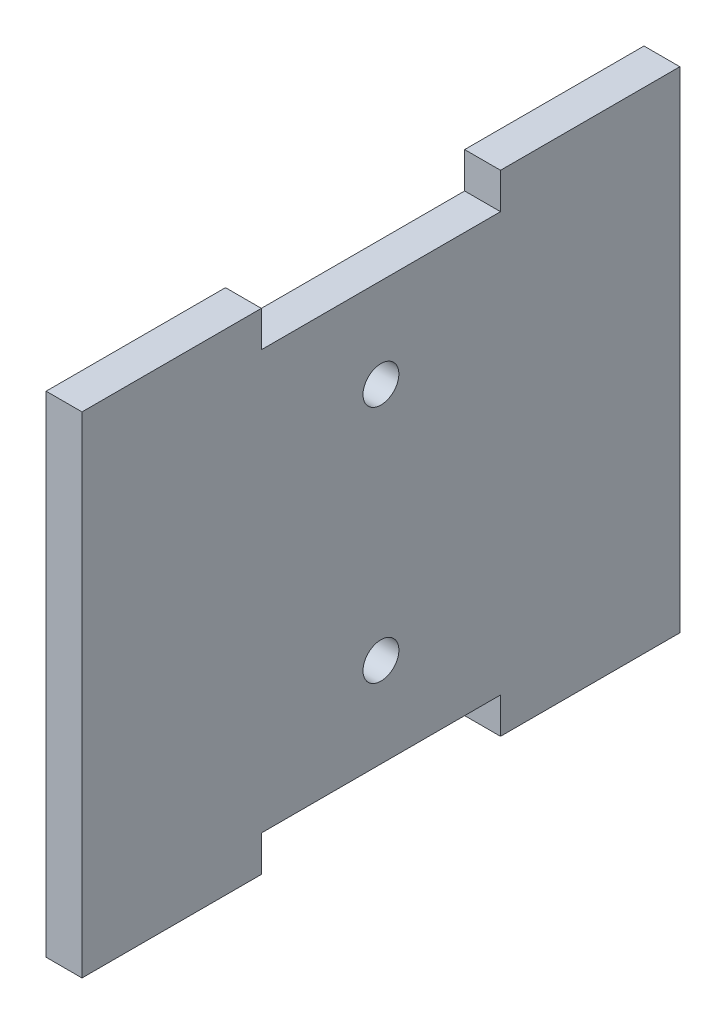
ISO-10303-21;
HEADER;
FILE_DESCRIPTION(('STEP AP214'),'2;1');
FILE_NAME('part.step','',(''),(''),'','','');
FILE_SCHEMA(('AUTOMOTIVE_DESIGN { 1 0 10303 214 1 1 1 1 }'));
ENDSEC;
DATA;
#1=APPLICATION_CONTEXT('core data for automotive mechanical design processes');
#2=APPLICATION_PROTOCOL_DEFINITION('international standard','automotive_design',2000,#1);
#3=PRODUCT_CONTEXT('',#1,'mechanical');
#4=PRODUCT('Part','Part','',(#3));
#5=PRODUCT_RELATED_PRODUCT_CATEGORY('part','',(#4));
#6=PRODUCT_DEFINITION_FORMATION('','',#4);
#7=PRODUCT_DEFINITION_CONTEXT('part definition',#1,'design');
#8=PRODUCT_DEFINITION('design','',#6,#7);
#9=PRODUCT_DEFINITION_SHAPE('','',#8);
#10=(LENGTH_UNIT() NAMED_UNIT(*) SI_UNIT(.MILLI.,.METRE.));
#11=(NAMED_UNIT(*) PLANE_ANGLE_UNIT() SI_UNIT($,.RADIAN.));
#12=(NAMED_UNIT(*) SI_UNIT($,.STERADIAN.) SOLID_ANGLE_UNIT());
#13=UNCERTAINTY_MEASURE_WITH_UNIT(LENGTH_MEASURE(1.E-05),#10,'distance_accuracy_value','');
#14=(GEOMETRIC_REPRESENTATION_CONTEXT(3) GLOBAL_UNCERTAINTY_ASSIGNED_CONTEXT((#13)) GLOBAL_UNIT_ASSIGNED_CONTEXT((#10,
#11,#12)) REPRESENTATION_CONTEXT('',''));
#15=CARTESIAN_POINT('',(0.,0.,0.));
#16=DIRECTION('',(0.,0.,1.));
#17=DIRECTION('',(1.,0.,0.));
#18=AXIS2_PLACEMENT_3D('',#15,#16,#17);
#19=CARTESIAN_POINT('',(3.,0.,0.));
#20=DIRECTION('',(-1.,0.,0.));
#21=DIRECTION('',(0.,0.,1.));
#22=AXIS2_PLACEMENT_3D('',#19,#20,#21);
#23=PLANE('',#22);
#24=DIRECTION('',(0.,1.,0.));
#25=VECTOR('',#24,1.);
#26=CARTESIAN_POINT('',(3.,-20.5,-25.));
#27=LINE('',#26,#25);
#28=CARTESIAN_POINT('',(3.,-20.5,-25.));
#29=VERTEX_POINT('',#28);
#30=CARTESIAN_POINT('',(3.,20.5,-25.));
#31=VERTEX_POINT('',#30);
#32=EDGE_CURVE('E179',#29,#31,#27,.T.);
#33=ORIENTED_EDGE('',*,*,#32,.T.);
#34=DIRECTION('',(0.,0.,1.));
#35=VECTOR('',#34,1.);
#36=CARTESIAN_POINT('',(3.,20.5,-10.));
#37=LINE('',#36,#35);
#38=CARTESIAN_POINT('',(3.,20.5,-10.));
#39=VERTEX_POINT('',#38);
#40=EDGE_CURVE('E107',#31,#39,#37,.T.);
#41=ORIENTED_EDGE('',*,*,#40,.T.);
#42=DIRECTION('',(0.,-1.,0.));
#43=VECTOR('',#42,1.);
#44=CARTESIAN_POINT('',(3.,17.5,-10.));
#45=LINE('',#44,#43);
#46=CARTESIAN_POINT('',(3.,17.5,-10.));
#47=VERTEX_POINT('',#46);
#48=EDGE_CURVE('E206',#39,#47,#45,.T.);
#49=ORIENTED_EDGE('',*,*,#48,.T.);
#50=DIRECTION('',(0.,0.,1.));
#51=VECTOR('',#50,1.);
#52=CARTESIAN_POINT('',(3.,17.5,10.));
#53=LINE('',#52,#51);
#54=CARTESIAN_POINT('',(3.,17.5,10.));
#55=VERTEX_POINT('',#54);
#56=EDGE_CURVE('E225',#47,#55,#53,.T.);
#57=ORIENTED_EDGE('',*,*,#56,.T.);
#58=DIRECTION('',(0.,1.,0.));
#59=VECTOR('',#58,1.);
#60=CARTESIAN_POINT('',(3.,17.5,10.));
#61=LINE('',#60,#59);
#62=CARTESIAN_POINT('',(3.,20.5,10.));
#63=VERTEX_POINT('',#62);
#64=EDGE_CURVE('E222',#55,#63,#61,.T.);
#65=ORIENTED_EDGE('',*,*,#64,.T.);
#66=DIRECTION('',(0.,0.,1.));
#67=VECTOR('',#66,1.);
#68=CARTESIAN_POINT('',(3.,20.5,10.));
#69=LINE('',#68,#67);
#70=CARTESIAN_POINT('',(3.,20.5,25.));
#71=VERTEX_POINT('',#70);
#72=EDGE_CURVE('E224',#63,#71,#69,.T.);
#73=ORIENTED_EDGE('',*,*,#72,.T.);
#74=DIRECTION('',(0.,-1.,0.));
#75=VECTOR('',#74,1.);
#76=CARTESIAN_POINT('',(3.,-20.5,25.));
#77=LINE('',#76,#75);
#78=CARTESIAN_POINT('',(3.,-20.5,25.));
#79=VERTEX_POINT('',#78);
#80=EDGE_CURVE('E227',#71,#79,#77,.T.);
#81=ORIENTED_EDGE('',*,*,#80,.T.);
#82=DIRECTION('',(0.,0.,-1.));
#83=VECTOR('',#82,1.);
#84=CARTESIAN_POINT('',(3.,-20.5,10.));
#85=LINE('',#84,#83);
#86=CARTESIAN_POINT('',(3.,-20.5,10.));
#87=VERTEX_POINT('',#86);
#88=EDGE_CURVE('E233',#79,#87,#85,.T.);
#89=ORIENTED_EDGE('',*,*,#88,.T.);
#90=DIRECTION('',(0.,1.,0.));
#91=VECTOR('',#90,1.);
#92=CARTESIAN_POINT('',(3.,-17.5,10.));
#93=LINE('',#92,#91);
#94=CARTESIAN_POINT('',(3.,-17.5,10.));
#95=VERTEX_POINT('',#94);
#96=EDGE_CURVE('E138',#87,#95,#93,.T.);
#97=ORIENTED_EDGE('',*,*,#96,.T.);
#98=DIRECTION('',(0.,0.,-1.));
#99=VECTOR('',#98,1.);
#100=CARTESIAN_POINT('',(3.,-17.5,10.));
#101=LINE('',#100,#99);
#102=CARTESIAN_POINT('',(3.,-17.5,-10.));
#103=VERTEX_POINT('',#102);
#104=EDGE_CURVE('E132',#95,#103,#101,.T.);
#105=ORIENTED_EDGE('',*,*,#104,.T.);
#106=DIRECTION('',(0.,-1.,0.));
#107=VECTOR('',#106,1.);
#108=CARTESIAN_POINT('',(3.,-17.5,-10.));
#109=LINE('',#108,#107);
#110=CARTESIAN_POINT('',(3.,-20.5,-10.));
#111=VERTEX_POINT('',#110);
#112=EDGE_CURVE('E136',#103,#111,#109,.T.);
#113=ORIENTED_EDGE('',*,*,#112,.T.);
#114=DIRECTION('',(0.,0.,-1.));
#115=VECTOR('',#114,1.);
#116=CARTESIAN_POINT('',(3.,-20.5,-10.));
#117=LINE('',#116,#115);
#118=EDGE_CURVE('E52',#111,#29,#117,.T.);
#119=ORIENTED_EDGE('',*,*,#118,.T.);
#120=EDGE_LOOP('',(#33,#41,#49,#57,#65,#73,#81,#89,#97,#105,#113,#119));
#121=FACE_BOUND('',#120,.T.);
#122=CARTESIAN_POINT('',(3.,-10.,0.));
#123=DIRECTION('',(1.,0.,0.));
#124=DIRECTION('',(0.,0.,-1.));
#125=AXIS2_PLACEMENT_3D('',#122,#123,#124);
#126=CIRCLE('',#125,1.5);
#127=CARTESIAN_POINT('',(3.,-10.,-1.5));
#128=VERTEX_POINT('',#127);
#129=EDGE_CURVE('E160',#128,#128,#126,.T.);
#130=ORIENTED_EDGE('',*,*,#129,.F.);
#131=EDGE_LOOP('',(#130));
#132=FACE_BOUND('',#131,.T.);
#133=CARTESIAN_POINT('',(3.,10.,0.));
#134=DIRECTION('',(1.,0.,0.));
#135=DIRECTION('',(0.,0.,1.));
#136=AXIS2_PLACEMENT_3D('',#133,#134,#135);
#137=CIRCLE('',#136,1.5);
#138=CARTESIAN_POINT('',(3.,10.,1.5));
#139=VERTEX_POINT('',#138);
#140=EDGE_CURVE('E274',#139,#139,#137,.T.);
#141=ORIENTED_EDGE('',*,*,#140,.F.);
#142=EDGE_LOOP('',(#141));
#143=FACE_BOUND('',#142,.T.);
#144=ADVANCED_FACE('F35',(#121,#132,#143),#23,.F.);
#145=CARTESIAN_POINT('',(0.,0.,0.));
#146=DIRECTION('',(-1.,0.,0.));
#147=DIRECTION('',(0.,0.,1.));
#148=AXIS2_PLACEMENT_3D('',#145,#146,#147);
#149=PLANE('',#148);
#150=CARTESIAN_POINT('',(0.,-10.,0.));
#151=DIRECTION('',(1.,0.,0.));
#152=DIRECTION('',(0.,0.,-1.));
#153=AXIS2_PLACEMENT_3D('',#150,#151,#152);
#154=CIRCLE('',#153,1.5);
#155=CARTESIAN_POINT('',(0.,-10.,-1.5));
#156=VERTEX_POINT('',#155);
#157=EDGE_CURVE('E279',#156,#156,#154,.T.);
#158=ORIENTED_EDGE('',*,*,#157,.T.);
#159=EDGE_LOOP('',(#158));
#160=FACE_BOUND('',#159,.T.);
#161=DIRECTION('',(0.,1.,0.));
#162=VECTOR('',#161,1.);
#163=CARTESIAN_POINT('',(0.,-20.5,-25.));
#164=LINE('',#163,#162);
#165=CARTESIAN_POINT('',(0.,-20.5,-25.));
#166=VERTEX_POINT('',#165);
#167=CARTESIAN_POINT('',(0.,20.5,-25.));
#168=VERTEX_POINT('',#167);
#169=EDGE_CURVE('E156',#166,#168,#164,.T.);
#170=ORIENTED_EDGE('',*,*,#169,.F.);
#171=DIRECTION('',(0.,0.,-1.));
#172=VECTOR('',#171,1.);
#173=CARTESIAN_POINT('',(0.,-20.5,-10.));
#174=LINE('',#173,#172);
#175=CARTESIAN_POINT('',(0.,-20.5,-10.));
#176=VERTEX_POINT('',#175);
#177=EDGE_CURVE('E99',#176,#166,#174,.T.);
#178=ORIENTED_EDGE('',*,*,#177,.F.);
#179=DIRECTION('',(0.,-1.,0.));
#180=VECTOR('',#179,1.);
#181=CARTESIAN_POINT('',(0.,-17.5,-10.));
#182=LINE('',#181,#180);
#183=CARTESIAN_POINT('',(0.,-17.5,-10.));
#184=VERTEX_POINT('',#183);
#185=EDGE_CURVE('E93',#184,#176,#182,.T.);
#186=ORIENTED_EDGE('',*,*,#185,.F.);
#187=DIRECTION('',(0.,0.,-1.));
#188=VECTOR('',#187,1.);
#189=CARTESIAN_POINT('',(0.,-17.5,10.));
#190=LINE('',#189,#188);
#191=CARTESIAN_POINT('',(0.,-17.5,10.));
#192=VERTEX_POINT('',#191);
#193=EDGE_CURVE('E146',#192,#184,#190,.T.);
#194=ORIENTED_EDGE('',*,*,#193,.F.);
#195=DIRECTION('',(0.,1.,0.));
#196=VECTOR('',#195,1.);
#197=CARTESIAN_POINT('',(0.,-17.5,10.));
#198=LINE('',#197,#196);
#199=CARTESIAN_POINT('',(0.,-20.5,10.));
#200=VERTEX_POINT('',#199);
#201=EDGE_CURVE('E174',#200,#192,#198,.T.);
#202=ORIENTED_EDGE('',*,*,#201,.F.);
#203=DIRECTION('',(0.,0.,-1.));
#204=VECTOR('',#203,1.);
#205=CARTESIAN_POINT('',(0.,-20.5,10.));
#206=LINE('',#205,#204);
#207=CARTESIAN_POINT('',(0.,-20.5,25.));
#208=VERTEX_POINT('',#207);
#209=EDGE_CURVE('E172',#208,#200,#206,.T.);
#210=ORIENTED_EDGE('',*,*,#209,.F.);
#211=DIRECTION('',(0.,-1.,0.));
#212=VECTOR('',#211,1.);
#213=CARTESIAN_POINT('',(0.,-20.5,25.));
#214=LINE('',#213,#212);
#215=CARTESIAN_POINT('',(0.,20.5,25.));
#216=VERTEX_POINT('',#215);
#217=EDGE_CURVE('E170',#216,#208,#214,.T.);
#218=ORIENTED_EDGE('',*,*,#217,.F.);
#219=DIRECTION('',(0.,0.,1.));
#220=VECTOR('',#219,1.);
#221=CARTESIAN_POINT('',(0.,20.5,10.));
#222=LINE('',#221,#220);
#223=CARTESIAN_POINT('',(0.,20.5,10.));
#224=VERTEX_POINT('',#223);
#225=EDGE_CURVE('E168',#224,#216,#222,.T.);
#226=ORIENTED_EDGE('',*,*,#225,.F.);
#227=DIRECTION('',(0.,1.,0.));
#228=VECTOR('',#227,1.);
#229=CARTESIAN_POINT('',(0.,17.5,10.));
#230=LINE('',#229,#228);
#231=CARTESIAN_POINT('',(0.,17.5,10.));
#232=VERTEX_POINT('',#231);
#233=EDGE_CURVE('E166',#232,#224,#230,.T.);
#234=ORIENTED_EDGE('',*,*,#233,.F.);
#235=DIRECTION('',(0.,0.,1.));
#236=VECTOR('',#235,1.);
#237=CARTESIAN_POINT('',(0.,17.5,10.));
#238=LINE('',#237,#236);
#239=CARTESIAN_POINT('',(0.,17.5,-10.));
#240=VERTEX_POINT('',#239);
#241=EDGE_CURVE('E164',#240,#232,#238,.T.);
#242=ORIENTED_EDGE('',*,*,#241,.F.);
#243=DIRECTION('',(0.,-1.,0.));
#244=VECTOR('',#243,1.);
#245=CARTESIAN_POINT('',(0.,17.5,-10.));
#246=LINE('',#245,#244);
#247=CARTESIAN_POINT('',(0.,20.5,-10.));
#248=VERTEX_POINT('',#247);
#249=EDGE_CURVE('E162',#248,#240,#246,.T.);
#250=ORIENTED_EDGE('',*,*,#249,.F.);
#251=DIRECTION('',(0.,0.,1.));
#252=VECTOR('',#251,1.);
#253=CARTESIAN_POINT('',(0.,20.5,-10.));
#254=LINE('',#253,#252);
#255=EDGE_CURVE('E159',#168,#248,#254,.T.);
#256=ORIENTED_EDGE('',*,*,#255,.F.);
#257=EDGE_LOOP('',(#170,#178,#186,#194,#202,#210,#218,#226,#234,#242,#250,#256));
#258=FACE_BOUND('',#257,.T.);
#259=CARTESIAN_POINT('',(0.,10.,0.));
#260=DIRECTION('',(1.,0.,0.));
#261=DIRECTION('',(0.,0.,1.));
#262=AXIS2_PLACEMENT_3D('',#259,#260,#261);
#263=CIRCLE('',#262,1.5);
#264=CARTESIAN_POINT('',(0.,10.,1.5));
#265=VERTEX_POINT('',#264);
#266=EDGE_CURVE('E277',#265,#265,#263,.T.);
#267=ORIENTED_EDGE('',*,*,#266,.T.);
#268=EDGE_LOOP('',(#267));
#269=FACE_BOUND('',#268,.T.);
#270=ADVANCED_FACE('F210',(#160,#258,#269),#149,.T.);
#271=CARTESIAN_POINT('',(3.,-20.5,-25.));
#272=DIRECTION('',(0.,0.,1.));
#273=DIRECTION('',(0.,-1.,0.));
#274=AXIS2_PLACEMENT_3D('',#271,#272,#273);
#275=PLANE('',#274);
#276=ORIENTED_EDGE('',*,*,#169,.T.);
#277=DIRECTION('',(-1.,0.,0.));
#278=VECTOR('',#277,1.);
#279=CARTESIAN_POINT('',(3.,20.5,-25.));
#280=LINE('',#279,#278);
#281=EDGE_CURVE('E11',#31,#168,#280,.T.);
#282=ORIENTED_EDGE('',*,*,#281,.F.);
#283=ORIENTED_EDGE('',*,*,#32,.F.);
#284=DIRECTION('',(-1.,0.,0.));
#285=VECTOR('',#284,1.);
#286=CARTESIAN_POINT('',(3.,-20.5,-25.));
#287=LINE('',#286,#285);
#288=EDGE_CURVE('E152',#29,#166,#287,.T.);
#289=ORIENTED_EDGE('',*,*,#288,.T.);
#290=EDGE_LOOP('',(#276,#282,#283,#289));
#291=FACE_BOUND('',#290,.T.);
#292=ADVANCED_FACE('F37',(#291),#275,.F.);
#293=CARTESIAN_POINT('',(3.,20.5,-10.));
#294=DIRECTION('',(0.,-1.,0.));
#295=DIRECTION('',(0.,0.,-1.));
#296=AXIS2_PLACEMENT_3D('',#293,#294,#295);
#297=PLANE('',#296);
#298=ORIENTED_EDGE('',*,*,#255,.T.);
#299=DIRECTION('',(-1.,0.,0.));
#300=VECTOR('',#299,1.);
#301=CARTESIAN_POINT('',(3.,20.5,-10.));
#302=LINE('',#301,#300);
#303=EDGE_CURVE('E44',#39,#248,#302,.T.);
#304=ORIENTED_EDGE('',*,*,#303,.F.);
#305=ORIENTED_EDGE('',*,*,#40,.F.);
#306=ORIENTED_EDGE('',*,*,#281,.T.);
#307=EDGE_LOOP('',(#298,#304,#305,#306));
#308=FACE_BOUND('',#307,.T.);
#309=ADVANCED_FACE('F374',(#308),#297,.F.);
#310=CARTESIAN_POINT('',(3.,17.5,-10.));
#311=DIRECTION('',(0.,0.,-1.));
#312=DIRECTION('',(0.,1.,0.));
#313=AXIS2_PLACEMENT_3D('',#310,#311,#312);
#314=PLANE('',#313);
#315=ORIENTED_EDGE('',*,*,#249,.T.);
#316=DIRECTION('',(-1.,0.,0.));
#317=VECTOR('',#316,1.);
#318=CARTESIAN_POINT('',(3.,17.5,-10.));
#319=LINE('',#318,#317);
#320=EDGE_CURVE('E198',#47,#240,#319,.T.);
#321=ORIENTED_EDGE('',*,*,#320,.F.);
#322=ORIENTED_EDGE('',*,*,#48,.F.);
#323=ORIENTED_EDGE('',*,*,#303,.T.);
#324=EDGE_LOOP('',(#315,#321,#322,#323));
#325=FACE_BOUND('',#324,.T.);
#326=ADVANCED_FACE('F204',(#325),#314,.F.);
#327=CARTESIAN_POINT('',(3.,17.5,10.));
#328=DIRECTION('',(0.,-1.,0.));
#329=DIRECTION('',(0.,0.,-1.));
#330=AXIS2_PLACEMENT_3D('',#327,#328,#329);
#331=PLANE('',#330);
#332=ORIENTED_EDGE('',*,*,#241,.T.);
#333=DIRECTION('',(-1.,0.,0.));
#334=VECTOR('',#333,1.);
#335=CARTESIAN_POINT('',(3.,17.5,10.));
#336=LINE('',#335,#334);
#337=EDGE_CURVE('E195',#55,#232,#336,.T.);
#338=ORIENTED_EDGE('',*,*,#337,.F.);
#339=ORIENTED_EDGE('',*,*,#56,.F.);
#340=ORIENTED_EDGE('',*,*,#320,.T.);
#341=EDGE_LOOP('',(#332,#338,#339,#340));
#342=FACE_BOUND('',#341,.T.);
#343=ADVANCED_FACE('F216',(#342),#331,.F.);
#344=CARTESIAN_POINT('',(3.,17.5,10.));
#345=DIRECTION('',(0.,0.,1.));
#346=DIRECTION('',(0.,-1.,0.));
#347=AXIS2_PLACEMENT_3D('',#344,#345,#346);
#348=PLANE('',#347);
#349=ORIENTED_EDGE('',*,*,#233,.T.);
#350=DIRECTION('',(-1.,0.,0.));
#351=VECTOR('',#350,1.);
#352=CARTESIAN_POINT('',(3.,20.5,10.));
#353=LINE('',#352,#351);
#354=EDGE_CURVE('E192',#63,#224,#353,.T.);
#355=ORIENTED_EDGE('',*,*,#354,.F.);
#356=ORIENTED_EDGE('',*,*,#64,.F.);
#357=ORIENTED_EDGE('',*,*,#337,.T.);
#358=EDGE_LOOP('',(#349,#355,#356,#357));
#359=FACE_BOUND('',#358,.T.);
#360=ADVANCED_FACE('F220',(#359),#348,.F.);
#361=CARTESIAN_POINT('',(3.,20.5,10.));
#362=DIRECTION('',(0.,-1.,0.));
#363=DIRECTION('',(0.,0.,-1.));
#364=AXIS2_PLACEMENT_3D('',#361,#362,#363);
#365=PLANE('',#364);
#366=ORIENTED_EDGE('',*,*,#225,.T.);
#367=DIRECTION('',(-1.,0.,0.));
#368=VECTOR('',#367,1.);
#369=CARTESIAN_POINT('',(3.,20.5,25.));
#370=LINE('',#369,#368);
#371=EDGE_CURVE('E189',#71,#216,#370,.T.);
#372=ORIENTED_EDGE('',*,*,#371,.F.);
#373=ORIENTED_EDGE('',*,*,#72,.F.);
#374=ORIENTED_EDGE('',*,*,#354,.T.);
#375=EDGE_LOOP('',(#366,#372,#373,#374));
#376=FACE_BOUND('',#375,.T.);
#377=ADVANCED_FACE('F339',(#376),#365,.F.);
#378=CARTESIAN_POINT('',(3.,-20.5,25.));
#379=DIRECTION('',(0.,0.,-1.));
#380=DIRECTION('',(0.,1.,0.));
#381=AXIS2_PLACEMENT_3D('',#378,#379,#380);
#382=PLANE('',#381);
#383=ORIENTED_EDGE('',*,*,#217,.T.);
#384=DIRECTION('',(-1.,0.,0.));
#385=VECTOR('',#384,1.);
#386=CARTESIAN_POINT('',(3.,-20.5,25.));
#387=LINE('',#386,#385);
#388=EDGE_CURVE('E186',#79,#208,#387,.T.);
#389=ORIENTED_EDGE('',*,*,#388,.F.);
#390=ORIENTED_EDGE('',*,*,#80,.F.);
#391=ORIENTED_EDGE('',*,*,#371,.T.);
#392=EDGE_LOOP('',(#383,#389,#390,#391));
#393=FACE_BOUND('',#392,.T.);
#394=ADVANCED_FACE('F330',(#393),#382,.F.);
#395=CARTESIAN_POINT('',(3.,-20.5,10.));
#396=DIRECTION('',(0.,1.,0.));
#397=DIRECTION('',(0.,0.,1.));
#398=AXIS2_PLACEMENT_3D('',#395,#396,#397);
#399=PLANE('',#398);
#400=ORIENTED_EDGE('',*,*,#209,.T.);
#401=DIRECTION('',(-1.,0.,0.));
#402=VECTOR('',#401,1.);
#403=CARTESIAN_POINT('',(3.,-20.5,10.));
#404=LINE('',#403,#402);
#405=EDGE_CURVE('E183',#87,#200,#404,.T.);
#406=ORIENTED_EDGE('',*,*,#405,.F.);
#407=ORIENTED_EDGE('',*,*,#88,.F.);
#408=ORIENTED_EDGE('',*,*,#388,.T.);
#409=EDGE_LOOP('',(#400,#406,#407,#408));
#410=FACE_BOUND('',#409,.T.);
#411=ADVANCED_FACE('F239',(#410),#399,.F.);
#412=CARTESIAN_POINT('',(3.,-17.5,10.));
#413=DIRECTION('',(0.,0.,1.));
#414=DIRECTION('',(0.,-1.,0.));
#415=AXIS2_PLACEMENT_3D('',#412,#413,#414);
#416=PLANE('',#415);
#417=ORIENTED_EDGE('',*,*,#201,.T.);
#418=DIRECTION('',(-1.,0.,0.));
#419=VECTOR('',#418,1.);
#420=CARTESIAN_POINT('',(3.,-17.5,10.));
#421=LINE('',#420,#419);
#422=EDGE_CURVE('E147',#95,#192,#421,.T.);
#423=ORIENTED_EDGE('',*,*,#422,.F.);
#424=ORIENTED_EDGE('',*,*,#96,.F.);
#425=ORIENTED_EDGE('',*,*,#405,.T.);
#426=EDGE_LOOP('',(#417,#423,#424,#425));
#427=FACE_BOUND('',#426,.T.);
#428=ADVANCED_FACE('F243',(#427),#416,.F.);
#429=CARTESIAN_POINT('',(3.,-17.5,10.));
#430=DIRECTION('',(0.,1.,0.));
#431=DIRECTION('',(0.,0.,1.));
#432=AXIS2_PLACEMENT_3D('',#429,#430,#431);
#433=PLANE('',#432);
#434=ORIENTED_EDGE('',*,*,#193,.T.);
#435=DIRECTION('',(-1.,0.,0.));
#436=VECTOR('',#435,1.);
#437=CARTESIAN_POINT('',(3.,-17.5,-10.));
#438=LINE('',#437,#436);
#439=EDGE_CURVE('E143',#103,#184,#438,.T.);
#440=ORIENTED_EDGE('',*,*,#439,.F.);
#441=ORIENTED_EDGE('',*,*,#104,.F.);
#442=ORIENTED_EDGE('',*,*,#422,.T.);
#443=EDGE_LOOP('',(#434,#440,#441,#442));
#444=FACE_BOUND('',#443,.T.);
#445=ADVANCED_FACE('F144',(#444),#433,.F.);
#446=CARTESIAN_POINT('',(3.,-17.5,-10.));
#447=DIRECTION('',(0.,0.,-1.));
#448=DIRECTION('',(0.,1.,0.));
#449=AXIS2_PLACEMENT_3D('',#446,#447,#448);
#450=PLANE('',#449);
#451=ORIENTED_EDGE('',*,*,#185,.T.);
#452=DIRECTION('',(-1.,0.,0.));
#453=VECTOR('',#452,1.);
#454=CARTESIAN_POINT('',(3.,-20.5,-10.));
#455=LINE('',#454,#453);
#456=EDGE_CURVE('E148',#111,#176,#455,.T.);
#457=ORIENTED_EDGE('',*,*,#456,.F.);
#458=ORIENTED_EDGE('',*,*,#112,.F.);
#459=ORIENTED_EDGE('',*,*,#439,.T.);
#460=EDGE_LOOP('',(#451,#457,#458,#459));
#461=FACE_BOUND('',#460,.T.);
#462=ADVANCED_FACE('F150',(#461),#450,.F.);
#463=CARTESIAN_POINT('',(3.,-20.5,-10.));
#464=DIRECTION('',(0.,1.,0.));
#465=DIRECTION('',(0.,0.,1.));
#466=AXIS2_PLACEMENT_3D('',#463,#464,#465);
#467=PLANE('',#466);
#468=ORIENTED_EDGE('',*,*,#177,.T.);
#469=ORIENTED_EDGE('',*,*,#288,.F.);
#470=ORIENTED_EDGE('',*,*,#118,.F.);
#471=ORIENTED_EDGE('',*,*,#456,.T.);
#472=EDGE_LOOP('',(#468,#469,#470,#471));
#473=FACE_BOUND('',#472,.T.);
#474=ADVANCED_FACE('F247',(#473),#467,.F.);
#475=CARTESIAN_POINT('',(3.,-10.,0.));
#476=DIRECTION('',(-1.,0.,0.));
#477=DIRECTION('',(0.,0.,1.));
#478=AXIS2_PLACEMENT_3D('',#475,#476,#477);
#479=CYLINDRICAL_SURFACE('',#478,1.5);
#480=ORIENTED_EDGE('',*,*,#129,.T.);
#481=EDGE_LOOP('',(#480));
#482=FACE_BOUND('',#481,.T.);
#483=ORIENTED_EDGE('',*,*,#157,.F.);
#484=EDGE_LOOP('',(#483));
#485=FACE_BOUND('',#484,.T.);
#486=ADVANCED_FACE('F249',(#482,#485),#479,.F.);
#487=CARTESIAN_POINT('',(3.,10.,0.));
#488=DIRECTION('',(-1.,0.,0.));
#489=DIRECTION('',(0.,0.,1.));
#490=AXIS2_PLACEMENT_3D('',#487,#488,#489);
#491=CYLINDRICAL_SURFACE('',#490,1.5);
#492=ORIENTED_EDGE('',*,*,#140,.T.);
#493=EDGE_LOOP('',(#492));
#494=FACE_BOUND('',#493,.T.);
#495=ORIENTED_EDGE('',*,*,#266,.F.);
#496=EDGE_LOOP('',(#495));
#497=FACE_BOUND('',#496,.T.);
#498=ADVANCED_FACE('F255',(#494,#497),#491,.F.);
#499=CLOSED_SHELL('',(#144,#270,#292,#309,#326,#343,#360,#377,#394,#411,#428,#445,#462,#474,
#486,#498));
#500=MANIFOLD_SOLID_BREP('B2',#499);
#501=ADVANCED_BREP_SHAPE_REPRESENTATION('',(#18,#500),#14);
#502=SHAPE_DEFINITION_REPRESENTATION(#9,#501);
ENDSEC;
END-ISO-10303-21;
